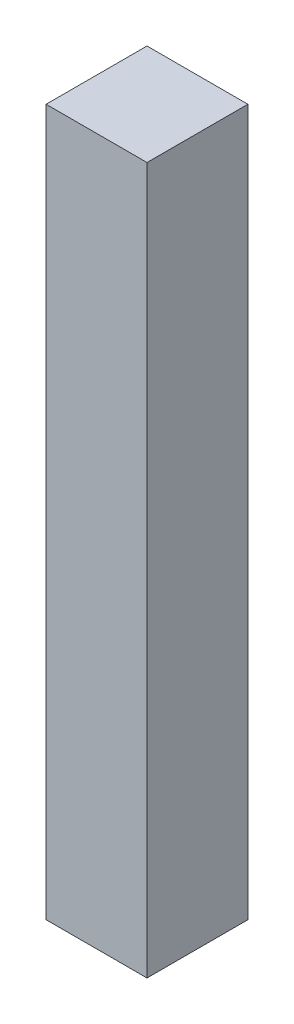
ISO-10303-21;
HEADER;
FILE_DESCRIPTION(('STEP AP214'),'2;1');
FILE_NAME('part.step','',(''),(''),'','','');
FILE_SCHEMA(('AUTOMOTIVE_DESIGN { 1 0 10303 214 1 1 1 1 }'));
ENDSEC;
DATA;
#1=APPLICATION_CONTEXT('core data for automotive mechanical design processes');
#2=APPLICATION_PROTOCOL_DEFINITION('international standard','automotive_design',2000,#1);
#3=PRODUCT_CONTEXT('',#1,'mechanical');
#4=PRODUCT('Part','Part','',(#3));
#5=PRODUCT_RELATED_PRODUCT_CATEGORY('part','',(#4));
#6=PRODUCT_DEFINITION_FORMATION('','',#4);
#7=PRODUCT_DEFINITION_CONTEXT('part definition',#1,'design');
#8=PRODUCT_DEFINITION('design','',#6,#7);
#9=PRODUCT_DEFINITION_SHAPE('','',#8);
#10=(LENGTH_UNIT() NAMED_UNIT(*) SI_UNIT(.MILLI.,.METRE.));
#11=(NAMED_UNIT(*) PLANE_ANGLE_UNIT() SI_UNIT($,.RADIAN.));
#12=(NAMED_UNIT(*) SI_UNIT($,.STERADIAN.) SOLID_ANGLE_UNIT());
#13=UNCERTAINTY_MEASURE_WITH_UNIT(LENGTH_MEASURE(1.E-05),#10,'distance_accuracy_value','');
#14=(GEOMETRIC_REPRESENTATION_CONTEXT(3) GLOBAL_UNCERTAINTY_ASSIGNED_CONTEXT((#13)) GLOBAL_UNIT_ASSIGNED_CONTEXT((#10,
#11,#12)) REPRESENTATION_CONTEXT('',''));
#15=CARTESIAN_POINT('',(0.,0.,0.));
#16=DIRECTION('',(0.,0.,1.));
#17=DIRECTION('',(1.,0.,0.));
#18=AXIS2_PLACEMENT_3D('',#15,#16,#17);
#19=CARTESIAN_POINT('',(25.,350.,25.));
#20=DIRECTION('',(-1.,0.,0.));
#21=DIRECTION('',(0.,0.,1.));
#22=AXIS2_PLACEMENT_3D('',#19,#20,#21);
#23=PLANE('',#22);
#24=DIRECTION('',(0.,0.,-1.));
#25=VECTOR('',#24,1.);
#26=CARTESIAN_POINT('',(25.,0.,25.));
#27=LINE('',#26,#25);
#28=CARTESIAN_POINT('',(25.,0.,25.));
#29=VERTEX_POINT('',#28);
#30=CARTESIAN_POINT('',(25.,0.,-25.));
#31=VERTEX_POINT('',#30);
#32=EDGE_CURVE('E95',#29,#31,#27,.T.);
#33=ORIENTED_EDGE('',*,*,#32,.T.);
#34=DIRECTION('',(0.,-1.,0.));
#35=VECTOR('',#34,1.);
#36=CARTESIAN_POINT('',(25.,350.,-25.));
#37=LINE('',#36,#35);
#38=CARTESIAN_POINT('',(25.,350.,-25.));
#39=VERTEX_POINT('',#38);
#40=EDGE_CURVE('E11',#39,#31,#37,.T.);
#41=ORIENTED_EDGE('',*,*,#40,.F.);
#42=DIRECTION('',(0.,0.,-1.));
#43=VECTOR('',#42,1.);
#44=CARTESIAN_POINT('',(25.,350.,25.));
#45=LINE('',#44,#43);
#46=CARTESIAN_POINT('',(25.,350.,25.));
#47=VERTEX_POINT('',#46);
#48=EDGE_CURVE('E83',#47,#39,#45,.T.);
#49=ORIENTED_EDGE('',*,*,#48,.F.);
#50=DIRECTION('',(0.,-1.,0.));
#51=VECTOR('',#50,1.);
#52=CARTESIAN_POINT('',(25.,350.,25.));
#53=LINE('',#52,#51);
#54=EDGE_CURVE('E91',#47,#29,#53,.T.);
#55=ORIENTED_EDGE('',*,*,#54,.T.);
#56=EDGE_LOOP('',(#33,#41,#49,#55));
#57=FACE_BOUND('',#56,.T.);
#58=ADVANCED_FACE('F32',(#57),#23,.F.);
#59=CARTESIAN_POINT('',(-25.,350.,-25.));
#60=DIRECTION('',(0.,0.,1.));
#61=DIRECTION('',(1.,0.,0.));
#62=AXIS2_PLACEMENT_3D('',#59,#60,#61);
#63=PLANE('',#62);
#64=DIRECTION('',(-1.,0.,0.));
#65=VECTOR('',#64,1.);
#66=CARTESIAN_POINT('',(-25.,0.,-25.));
#67=LINE('',#66,#65);
#68=CARTESIAN_POINT('',(-25.,0.,-25.));
#69=VERTEX_POINT('',#68);
#70=EDGE_CURVE('E87',#31,#69,#67,.T.);
#71=ORIENTED_EDGE('',*,*,#70,.T.);
#72=DIRECTION('',(0.,-1.,0.));
#73=VECTOR('',#72,1.);
#74=CARTESIAN_POINT('',(-25.,350.,-25.));
#75=LINE('',#74,#73);
#76=CARTESIAN_POINT('',(-25.,350.,-25.));
#77=VERTEX_POINT('',#76);
#78=EDGE_CURVE('E40',#77,#69,#75,.T.);
#79=ORIENTED_EDGE('',*,*,#78,.F.);
#80=DIRECTION('',(-1.,0.,0.));
#81=VECTOR('',#80,1.);
#82=CARTESIAN_POINT('',(-25.,350.,-25.));
#83=LINE('',#82,#81);
#84=EDGE_CURVE('E78',#39,#77,#83,.T.);
#85=ORIENTED_EDGE('',*,*,#84,.F.);
#86=ORIENTED_EDGE('',*,*,#40,.T.);
#87=EDGE_LOOP('',(#71,#79,#85,#86));
#88=FACE_BOUND('',#87,.T.);
#89=ADVANCED_FACE('F86',(#88),#63,.F.);
#90=CARTESIAN_POINT('',(-25.,350.,25.));
#91=DIRECTION('',(1.,0.,0.));
#92=DIRECTION('',(0.,0.,-1.));
#93=AXIS2_PLACEMENT_3D('',#90,#91,#92);
#94=PLANE('',#93);
#95=DIRECTION('',(0.,0.,1.));
#96=VECTOR('',#95,1.);
#97=CARTESIAN_POINT('',(-25.,0.,25.));
#98=LINE('',#97,#96);
#99=CARTESIAN_POINT('',(-25.,0.,25.));
#100=VERTEX_POINT('',#99);
#101=EDGE_CURVE('E65',#69,#100,#98,.T.);
#102=ORIENTED_EDGE('',*,*,#101,.T.);
#103=DIRECTION('',(0.,-1.,0.));
#104=VECTOR('',#103,1.);
#105=CARTESIAN_POINT('',(-25.,350.,25.));
#106=LINE('',#105,#104);
#107=CARTESIAN_POINT('',(-25.,350.,25.));
#108=VERTEX_POINT('',#107);
#109=EDGE_CURVE('E88',#108,#100,#106,.T.);
#110=ORIENTED_EDGE('',*,*,#109,.F.);
#111=DIRECTION('',(0.,0.,1.));
#112=VECTOR('',#111,1.);
#113=CARTESIAN_POINT('',(-25.,350.,25.));
#114=LINE('',#113,#112);
#115=EDGE_CURVE('E81',#77,#108,#114,.T.);
#116=ORIENTED_EDGE('',*,*,#115,.F.);
#117=ORIENTED_EDGE('',*,*,#78,.T.);
#118=EDGE_LOOP('',(#102,#110,#116,#117));
#119=FACE_BOUND('',#118,.T.);
#120=ADVANCED_FACE('F89',(#119),#94,.F.);
#121=CARTESIAN_POINT('',(-25.,350.,25.));
#122=DIRECTION('',(0.,0.,-1.));
#123=DIRECTION('',(-1.,0.,0.));
#124=AXIS2_PLACEMENT_3D('',#121,#122,#123);
#125=PLANE('',#124);
#126=DIRECTION('',(1.,0.,0.));
#127=VECTOR('',#126,1.);
#128=CARTESIAN_POINT('',(-25.,0.,25.));
#129=LINE('',#128,#127);
#130=EDGE_CURVE('E71',#100,#29,#129,.T.);
#131=ORIENTED_EDGE('',*,*,#130,.T.);
#132=ORIENTED_EDGE('',*,*,#54,.F.);
#133=DIRECTION('',(1.,0.,0.));
#134=VECTOR('',#133,1.);
#135=CARTESIAN_POINT('',(-25.,350.,25.));
#136=LINE('',#135,#134);
#137=EDGE_CURVE('E48',#108,#47,#136,.T.);
#138=ORIENTED_EDGE('',*,*,#137,.F.);
#139=ORIENTED_EDGE('',*,*,#109,.T.);
#140=EDGE_LOOP('',(#131,#132,#138,#139));
#141=FACE_BOUND('',#140,.T.);
#142=ADVANCED_FACE('F102',(#141),#125,.F.);
#143=CARTESIAN_POINT('',(0.,350.,0.));
#144=DIRECTION('',(0.,-1.,0.));
#145=DIRECTION('',(0.,0.,-1.));
#146=AXIS2_PLACEMENT_3D('',#143,#144,#145);
#147=PLANE('',#146);
#148=ORIENTED_EDGE('',*,*,#48,.T.);
#149=ORIENTED_EDGE('',*,*,#84,.T.);
#150=ORIENTED_EDGE('',*,*,#115,.T.);
#151=ORIENTED_EDGE('',*,*,#137,.T.);
#152=EDGE_LOOP('',(#148,#149,#150,#151));
#153=FACE_BOUND('',#152,.T.);
#154=ADVANCED_FACE('F79',(#153),#147,.F.);
#155=CARTESIAN_POINT('',(0.,0.,0.));
#156=DIRECTION('',(0.,-1.,0.));
#157=DIRECTION('',(0.,0.,-1.));
#158=AXIS2_PLACEMENT_3D('',#155,#156,#157);
#159=PLANE('',#158);
#160=ORIENTED_EDGE('',*,*,#32,.F.);
#161=ORIENTED_EDGE('',*,*,#130,.F.);
#162=ORIENTED_EDGE('',*,*,#101,.F.);
#163=ORIENTED_EDGE('',*,*,#70,.F.);
#164=EDGE_LOOP('',(#160,#161,#162,#163));
#165=FACE_BOUND('',#164,.T.);
#166=ADVANCED_FACE('F105',(#165),#159,.T.);
#167=CLOSED_SHELL('',(#58,#89,#120,#142,#154,#166));
#168=MANIFOLD_SOLID_BREP('B2',#167);
#169=ADVANCED_BREP_SHAPE_REPRESENTATION('',(#18,#168),#14);
#170=SHAPE_DEFINITION_REPRESENTATION(#9,#169);
ENDSEC;
END-ISO-10303-21;
